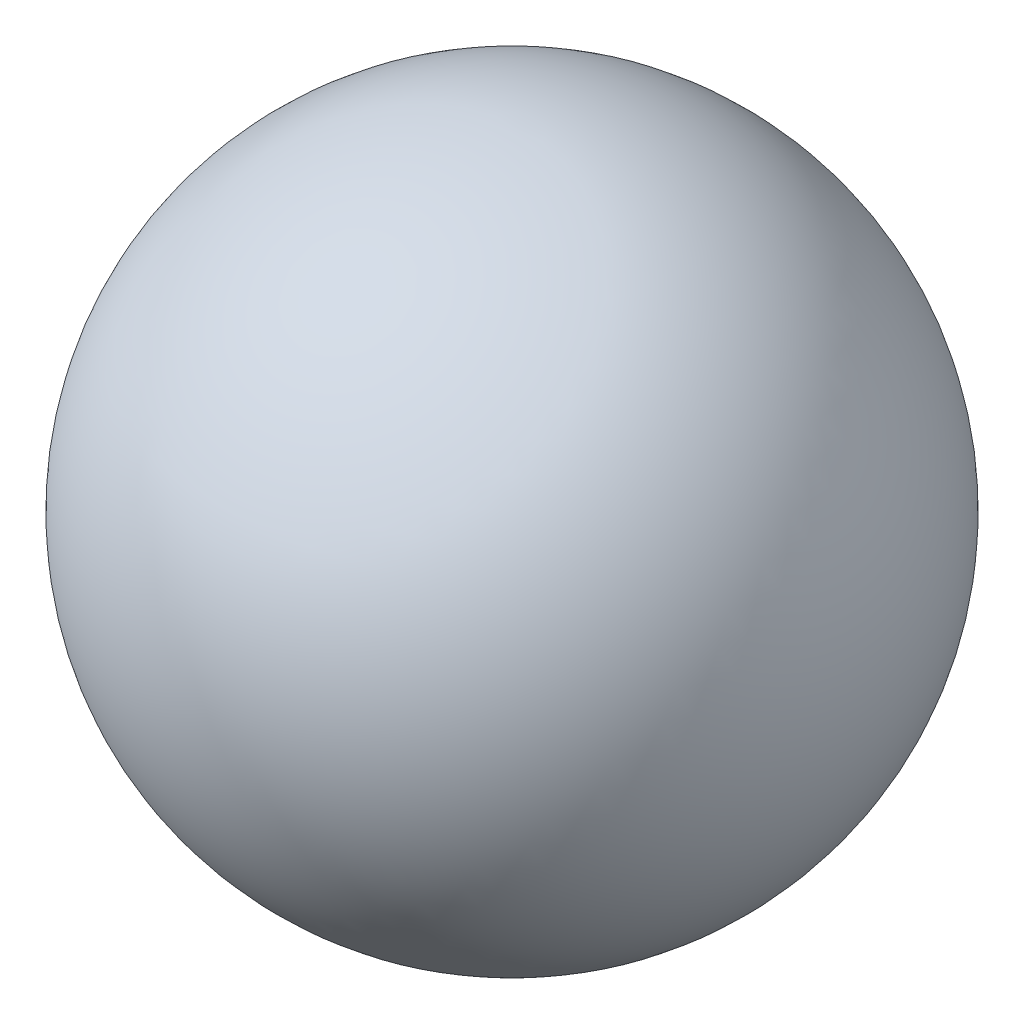
ISO-10303-21;
HEADER;
FILE_DESCRIPTION(('STEP AP214'),'2;1');
FILE_NAME('part.step','',(''),(''),'','','');
FILE_SCHEMA(('AUTOMOTIVE_DESIGN { 1 0 10303 214 1 1 1 1 }'));
ENDSEC;
DATA;
#1=APPLICATION_CONTEXT('core data for automotive mechanical design processes');
#2=APPLICATION_PROTOCOL_DEFINITION('international standard','automotive_design',2000,#1);
#3=PRODUCT_CONTEXT('',#1,'mechanical');
#4=PRODUCT('Part','Part','',(#3));
#5=PRODUCT_RELATED_PRODUCT_CATEGORY('part','',(#4));
#6=PRODUCT_DEFINITION_FORMATION('','',#4);
#7=PRODUCT_DEFINITION_CONTEXT('part definition',#1,'design');
#8=PRODUCT_DEFINITION('design','',#6,#7);
#9=PRODUCT_DEFINITION_SHAPE('','',#8);
#10=(LENGTH_UNIT() NAMED_UNIT(*) SI_UNIT(.MILLI.,.METRE.));
#11=(NAMED_UNIT(*) PLANE_ANGLE_UNIT() SI_UNIT($,.RADIAN.));
#12=(NAMED_UNIT(*) SI_UNIT($,.STERADIAN.) SOLID_ANGLE_UNIT());
#13=UNCERTAINTY_MEASURE_WITH_UNIT(LENGTH_MEASURE(1.E-05),#10,'distance_accuracy_value','');
#14=(GEOMETRIC_REPRESENTATION_CONTEXT(3) GLOBAL_UNCERTAINTY_ASSIGNED_CONTEXT((#13)) GLOBAL_UNIT_ASSIGNED_CONTEXT((#10,
#11,#12)) REPRESENTATION_CONTEXT('',''));
#15=CARTESIAN_POINT('',(0.,0.,0.));
#16=DIRECTION('',(0.,0.,1.));
#17=DIRECTION('',(1.,0.,0.));
#18=AXIS2_PLACEMENT_3D('',#15,#16,#17);
#19=CARTESIAN_POINT('',(-16.8079325673063,-102.86178580506,426.745458025978));
#20=DIRECTION('',(0.,1.,0.));
#21=DIRECTION('',(0.707106781186551,0.,0.707106781186544));
#22=AXIS2_PLACEMENT_3D('',#19,#20,#21);
#23=SPHERICAL_SURFACE('',#22,2.);
#24=CARTESIAN_POINT('',(-16.8079325673063,-100.86178580506,426.745458025978));
#25=VERTEX_POINT('',#24);
#26=VERTEX_LOOP('',#25);
#27=FACE_BOUND('',#26,.T.);
#28=ADVANCED_FACE('F31',(#27),#23,.T.);
#29=CLOSED_SHELL('',(#28));
#30=MANIFOLD_SOLID_BREP('B2',#29);
#31=ADVANCED_BREP_SHAPE_REPRESENTATION('',(#18,#30),#14);
#32=SHAPE_DEFINITION_REPRESENTATION(#9,#31);
ENDSEC;
END-ISO-10303-21;
